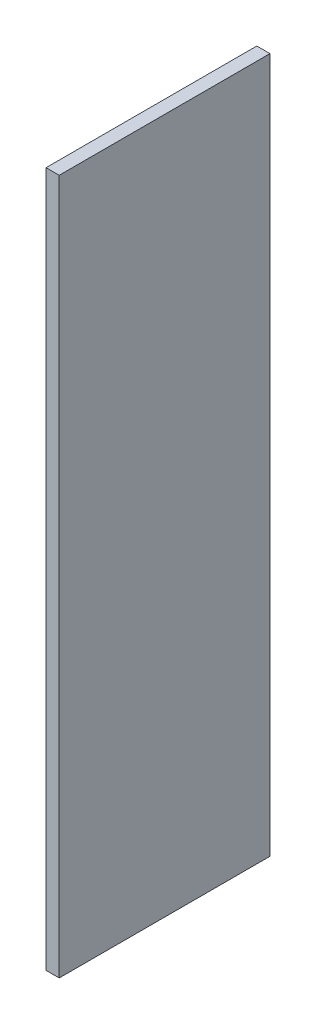
ISO-10303-21;
HEADER;
FILE_DESCRIPTION(('STEP AP214'),'2;1');
FILE_NAME('part.step','',(''),(''),'','','');
FILE_SCHEMA(('AUTOMOTIVE_DESIGN { 1 0 10303 214 1 1 1 1 }'));
ENDSEC;
DATA;
#1=APPLICATION_CONTEXT('core data for automotive mechanical design processes');
#2=APPLICATION_PROTOCOL_DEFINITION('international standard','automotive_design',2000,#1);
#3=PRODUCT_CONTEXT('',#1,'mechanical');
#4=PRODUCT('Part','Part','',(#3));
#5=PRODUCT_RELATED_PRODUCT_CATEGORY('part','',(#4));
#6=PRODUCT_DEFINITION_FORMATION('','',#4);
#7=PRODUCT_DEFINITION_CONTEXT('part definition',#1,'design');
#8=PRODUCT_DEFINITION('design','',#6,#7);
#9=PRODUCT_DEFINITION_SHAPE('','',#8);
#10=(LENGTH_UNIT() NAMED_UNIT(*) SI_UNIT(.MILLI.,.METRE.));
#11=(NAMED_UNIT(*) PLANE_ANGLE_UNIT() SI_UNIT($,.RADIAN.));
#12=(NAMED_UNIT(*) SI_UNIT($,.STERADIAN.) SOLID_ANGLE_UNIT());
#13=UNCERTAINTY_MEASURE_WITH_UNIT(LENGTH_MEASURE(1.E-05),#10,'distance_accuracy_value','');
#14=(GEOMETRIC_REPRESENTATION_CONTEXT(3) GLOBAL_UNCERTAINTY_ASSIGNED_CONTEXT((#13)) GLOBAL_UNIT_ASSIGNED_CONTEXT((#10,
#11,#12)) REPRESENTATION_CONTEXT('',''));
#15=CARTESIAN_POINT('',(0.,0.,0.));
#16=DIRECTION('',(0.,0.,1.));
#17=DIRECTION('',(1.,0.,0.));
#18=AXIS2_PLACEMENT_3D('',#15,#16,#17);
#19=CARTESIAN_POINT('',(18.,-892.219556499024,267.607933188847));
#20=DIRECTION('',(0.,0.,-1.));
#21=DIRECTION('',(-1.,0.,0.));
#22=AXIS2_PLACEMENT_3D('',#19,#20,#21);
#23=PLANE('',#22);
#24=DIRECTION('',(0.,-1.,0.));
#25=VECTOR('',#24,1.);
#26=CARTESIAN_POINT('',(0.,-892.219556499024,267.607933188847));
#27=LINE('',#26,#25);
#28=CARTESIAN_POINT('',(0.,57.7804435009756,267.607933188847));
#29=VERTEX_POINT('',#28);
#30=CARTESIAN_POINT('',(0.,-892.219556499024,267.607933188847));
#31=VERTEX_POINT('',#30);
#32=EDGE_CURVE('E95',#29,#31,#27,.T.);
#33=ORIENTED_EDGE('',*,*,#32,.T.);
#34=DIRECTION('',(-1.,0.,0.));
#35=VECTOR('',#34,1.);
#36=CARTESIAN_POINT('',(18.,-892.219556499024,267.607933188847));
#37=LINE('',#36,#35);
#38=CARTESIAN_POINT('',(18.,-892.219556499024,267.607933188847));
#39=VERTEX_POINT('',#38);
#40=EDGE_CURVE('E11',#39,#31,#37,.T.);
#41=ORIENTED_EDGE('',*,*,#40,.F.);
#42=DIRECTION('',(0.,-1.,0.));
#43=VECTOR('',#42,1.);
#44=CARTESIAN_POINT('',(18.,-892.219556499024,267.607933188847));
#45=LINE('',#44,#43);
#46=CARTESIAN_POINT('',(18.,57.7804435009756,267.607933188847));
#47=VERTEX_POINT('',#46);
#48=EDGE_CURVE('E83',#47,#39,#45,.T.);
#49=ORIENTED_EDGE('',*,*,#48,.F.);
#50=DIRECTION('',(-1.,0.,0.));
#51=VECTOR('',#50,1.);
#52=CARTESIAN_POINT('',(18.,57.7804435009756,267.607933188847));
#53=LINE('',#52,#51);
#54=EDGE_CURVE('E91',#47,#29,#53,.T.);
#55=ORIENTED_EDGE('',*,*,#54,.T.);
#56=EDGE_LOOP('',(#33,#41,#49,#55));
#57=FACE_BOUND('',#56,.T.);
#58=ADVANCED_FACE('F32',(#57),#23,.F.);
#59=CARTESIAN_POINT('',(18.,-892.219556499024,-20.392066811153));
#60=DIRECTION('',(0.,1.,0.));
#61=DIRECTION('',(0.,0.,1.));
#62=AXIS2_PLACEMENT_3D('',#59,#60,#61);
#63=PLANE('',#62);
#64=DIRECTION('',(0.,0.,-1.));
#65=VECTOR('',#64,1.);
#66=CARTESIAN_POINT('',(0.,-892.219556499024,-20.392066811153));
#67=LINE('',#66,#65);
#68=CARTESIAN_POINT('',(0.,-892.219556499024,-20.392066811153));
#69=VERTEX_POINT('',#68);
#70=EDGE_CURVE('E87',#31,#69,#67,.T.);
#71=ORIENTED_EDGE('',*,*,#70,.T.);
#72=DIRECTION('',(-1.,0.,0.));
#73=VECTOR('',#72,1.);
#74=CARTESIAN_POINT('',(18.,-892.219556499024,-20.392066811153));
#75=LINE('',#74,#73);
#76=CARTESIAN_POINT('',(18.,-892.219556499024,-20.392066811153));
#77=VERTEX_POINT('',#76);
#78=EDGE_CURVE('E40',#77,#69,#75,.T.);
#79=ORIENTED_EDGE('',*,*,#78,.F.);
#80=DIRECTION('',(0.,0.,-1.));
#81=VECTOR('',#80,1.);
#82=CARTESIAN_POINT('',(18.,-892.219556499024,-20.392066811153));
#83=LINE('',#82,#81);
#84=EDGE_CURVE('E78',#39,#77,#83,.T.);
#85=ORIENTED_EDGE('',*,*,#84,.F.);
#86=ORIENTED_EDGE('',*,*,#40,.T.);
#87=EDGE_LOOP('',(#71,#79,#85,#86));
#88=FACE_BOUND('',#87,.T.);
#89=ADVANCED_FACE('F86',(#88),#63,.F.);
#90=CARTESIAN_POINT('',(18.,-892.219556499024,-20.392066811153));
#91=DIRECTION('',(0.,0.,1.));
#92=DIRECTION('',(1.,0.,0.));
#93=AXIS2_PLACEMENT_3D('',#90,#91,#92);
#94=PLANE('',#93);
#95=DIRECTION('',(0.,1.,0.));
#96=VECTOR('',#95,1.);
#97=CARTESIAN_POINT('',(0.,-892.219556499024,-20.392066811153));
#98=LINE('',#97,#96);
#99=CARTESIAN_POINT('',(0.,57.7804435009756,-20.392066811153));
#100=VERTEX_POINT('',#99);
#101=EDGE_CURVE('E65',#69,#100,#98,.T.);
#102=ORIENTED_EDGE('',*,*,#101,.T.);
#103=DIRECTION('',(-1.,0.,0.));
#104=VECTOR('',#103,1.);
#105=CARTESIAN_POINT('',(18.,57.7804435009756,-20.392066811153));
#106=LINE('',#105,#104);
#107=CARTESIAN_POINT('',(18.,57.7804435009756,-20.392066811153));
#108=VERTEX_POINT('',#107);
#109=EDGE_CURVE('E88',#108,#100,#106,.T.);
#110=ORIENTED_EDGE('',*,*,#109,.F.);
#111=DIRECTION('',(0.,1.,0.));
#112=VECTOR('',#111,1.);
#113=CARTESIAN_POINT('',(18.,-892.219556499024,-20.392066811153));
#114=LINE('',#113,#112);
#115=EDGE_CURVE('E81',#77,#108,#114,.T.);
#116=ORIENTED_EDGE('',*,*,#115,.F.);
#117=ORIENTED_EDGE('',*,*,#78,.T.);
#118=EDGE_LOOP('',(#102,#110,#116,#117));
#119=FACE_BOUND('',#118,.T.);
#120=ADVANCED_FACE('F89',(#119),#94,.F.);
#121=CARTESIAN_POINT('',(18.,57.7804435009756,-20.392066811153));
#122=DIRECTION('',(0.,-1.,0.));
#123=DIRECTION('',(0.,0.,-1.));
#124=AXIS2_PLACEMENT_3D('',#121,#122,#123);
#125=PLANE('',#124);
#126=DIRECTION('',(0.,0.,1.));
#127=VECTOR('',#126,1.);
#128=CARTESIAN_POINT('',(0.,57.7804435009756,-20.392066811153));
#129=LINE('',#128,#127);
#130=EDGE_CURVE('E71',#100,#29,#129,.T.);
#131=ORIENTED_EDGE('',*,*,#130,.T.);
#132=ORIENTED_EDGE('',*,*,#54,.F.);
#133=DIRECTION('',(0.,0.,1.));
#134=VECTOR('',#133,1.);
#135=CARTESIAN_POINT('',(18.,57.7804435009756,-20.392066811153));
#136=LINE('',#135,#134);
#137=EDGE_CURVE('E48',#108,#47,#136,.T.);
#138=ORIENTED_EDGE('',*,*,#137,.F.);
#139=ORIENTED_EDGE('',*,*,#109,.T.);
#140=EDGE_LOOP('',(#131,#132,#138,#139));
#141=FACE_BOUND('',#140,.T.);
#142=ADVANCED_FACE('F102',(#141),#125,.F.);
#143=CARTESIAN_POINT('',(18.,0.,0.));
#144=DIRECTION('',(1.,0.,0.));
#145=DIRECTION('',(0.,0.,-1.));
#146=AXIS2_PLACEMENT_3D('',#143,#144,#145);
#147=PLANE('',#146);
#148=ORIENTED_EDGE('',*,*,#48,.T.);
#149=ORIENTED_EDGE('',*,*,#84,.T.);
#150=ORIENTED_EDGE('',*,*,#115,.T.);
#151=ORIENTED_EDGE('',*,*,#137,.T.);
#152=EDGE_LOOP('',(#148,#149,#150,#151));
#153=FACE_BOUND('',#152,.T.);
#154=ADVANCED_FACE('F79',(#153),#147,.T.);
#155=CARTESIAN_POINT('',(0.,0.,0.));
#156=DIRECTION('',(1.,0.,0.));
#157=DIRECTION('',(0.,0.,-1.));
#158=AXIS2_PLACEMENT_3D('',#155,#156,#157);
#159=PLANE('',#158);
#160=ORIENTED_EDGE('',*,*,#32,.F.);
#161=ORIENTED_EDGE('',*,*,#130,.F.);
#162=ORIENTED_EDGE('',*,*,#101,.F.);
#163=ORIENTED_EDGE('',*,*,#70,.F.);
#164=EDGE_LOOP('',(#160,#161,#162,#163));
#165=FACE_BOUND('',#164,.T.);
#166=ADVANCED_FACE('F105',(#165),#159,.F.);
#167=CLOSED_SHELL('',(#58,#89,#120,#142,#154,#166));
#168=MANIFOLD_SOLID_BREP('B2',#167);
#169=ADVANCED_BREP_SHAPE_REPRESENTATION('',(#18,#168),#14);
#170=SHAPE_DEFINITION_REPRESENTATION(#9,#169);
ENDSEC;
END-ISO-10303-21;
